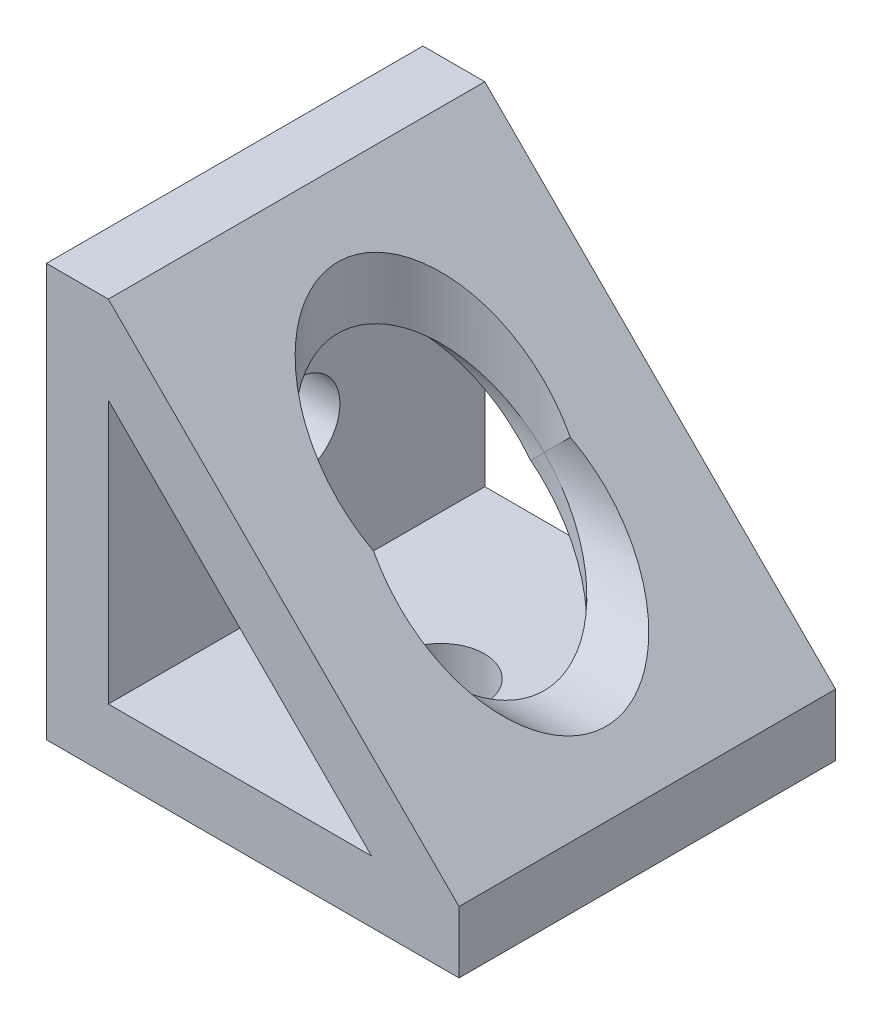
ISO-10303-21;
HEADER;
FILE_DESCRIPTION(('STEP AP214'),'2;1');
FILE_NAME('part.step','',(''),(''),'','','');
FILE_SCHEMA(('AUTOMOTIVE_DESIGN { 1 0 10303 214 1 1 1 1 }'));
ENDSEC;
DATA;
#1=APPLICATION_CONTEXT('core data for automotive mechanical design processes');
#2=APPLICATION_PROTOCOL_DEFINITION('international standard','automotive_design',2000,#1);
#3=PRODUCT_CONTEXT('',#1,'mechanical');
#4=PRODUCT('Part','Part','',(#3));
#5=PRODUCT_RELATED_PRODUCT_CATEGORY('part','',(#4));
#6=PRODUCT_DEFINITION_FORMATION('','',#4);
#7=PRODUCT_DEFINITION_CONTEXT('part definition',#1,'design');
#8=PRODUCT_DEFINITION('design','',#6,#7);
#9=PRODUCT_DEFINITION_SHAPE('','',#8);
#10=(LENGTH_UNIT() NAMED_UNIT(*) SI_UNIT(.MILLI.,.METRE.));
#11=(NAMED_UNIT(*) PLANE_ANGLE_UNIT() SI_UNIT($,.RADIAN.));
#12=(NAMED_UNIT(*) SI_UNIT($,.STERADIAN.) SOLID_ANGLE_UNIT());
#13=UNCERTAINTY_MEASURE_WITH_UNIT(LENGTH_MEASURE(1.E-05),#10,'distance_accuracy_value','');
#14=(GEOMETRIC_REPRESENTATION_CONTEXT(3) GLOBAL_UNCERTAINTY_ASSIGNED_CONTEXT((#13)) GLOBAL_UNIT_ASSIGNED_CONTEXT((#10,
#11,#12)) REPRESENTATION_CONTEXT('',''));
#15=CARTESIAN_POINT('',(0.,0.,0.));
#16=DIRECTION('',(0.,0.,1.));
#17=DIRECTION('',(1.,0.,0.));
#18=AXIS2_PLACEMENT_3D('',#15,#16,#17);
#19=CARTESIAN_POINT('',(0.,20.,0.));
#20=DIRECTION('',(0.,-1.,0.));
#21=DIRECTION('',(0.,0.,-1.));
#22=AXIS2_PLACEMENT_3D('',#19,#20,#21);
#23=CYLINDRICAL_SURFACE('',#22,10.);
#24=CARTESIAN_POINT('',(0.,0.,0.));
#25=DIRECTION('',(-0.707106781186548,-0.707106781186547,0.));
#26=DIRECTION('',(0.707106781186547,-0.707106781186548,0.));
#27=AXIS2_PLACEMENT_3D('',#24,#25,#26);
#28=ELLIPSE('',#27,14.1421356237309,10.);
#29=CARTESIAN_POINT('',(0.,0.,-10.));
#30=VERTEX_POINT('',#29);
#31=CARTESIAN_POINT('',(0.,0.,10.));
#32=VERTEX_POINT('',#31);
#33=EDGE_CURVE('E11',#30,#32,#28,.F.);
#34=ORIENTED_EDGE('',*,*,#33,.F.);
#35=CARTESIAN_POINT('',(0.,0.,0.));
#36=DIRECTION('',(0.707106781186547,-0.707106781186548,0.));
#37=DIRECTION('',(-0.707106781186548,-0.707106781186547,0.));
#38=AXIS2_PLACEMENT_3D('',#35,#36,#37);
#39=ELLIPSE('',#38,14.1421356237309,10.);
#40=CARTESIAN_POINT('',(3.,3.,-9.53939201416945));
#41=VERTEX_POINT('',#40);
#42=EDGE_CURVE('E121',#41,#30,#39,.F.);
#43=ORIENTED_EDGE('',*,*,#42,.F.);
#44=CARTESIAN_POINT('',(0.,6.,0.));
#45=DIRECTION('',(0.707106781186548,0.707106781186548,0.));
#46=DIRECTION('',(0.707106781186548,-0.707106781186548,0.));
#47=AXIS2_PLACEMENT_3D('',#44,#45,#46);
#48=ELLIPSE('',#47,14.1421356237309,10.);
#49=CARTESIAN_POINT('',(3.00000000000001,2.99999999999998,9.53939201416945));
#50=VERTEX_POINT('',#49);
#51=EDGE_CURVE('E205',#50,#41,#48,.F.);
#52=ORIENTED_EDGE('',*,*,#51,.F.);
#53=EDGE_CURVE('E120',#32,#50,#39,.F.);
#54=ORIENTED_EDGE('',*,*,#53,.F.);
#55=EDGE_LOOP('',(#34,#43,#52,#54));
#56=FACE_BOUND('',#55,.T.);
#57=ADVANCED_FACE('F34',(#56),#23,.F.);
#58=CARTESIAN_POINT('',(-14.,20.,-18.25));
#59=DIRECTION('',(0.,1.,0.));
#60=DIRECTION('',(0.,0.,1.));
#61=AXIS2_PLACEMENT_3D('',#58,#59,#60);
#62=PLANE('',#61);
#63=DIRECTION('',(0.,0.,1.));
#64=VECTOR('',#63,1.);
#65=CARTESIAN_POINT('',(-20.,20.,-18.25));
#66=LINE('',#65,#64);
#67=CARTESIAN_POINT('',(-20.,20.,-18.25));
#68=VERTEX_POINT('',#67);
#69=CARTESIAN_POINT('',(-20.,20.,18.25));
#70=VERTEX_POINT('',#69);
#71=EDGE_CURVE('E136',#68,#70,#66,.T.);
#72=ORIENTED_EDGE('',*,*,#71,.T.);
#73=DIRECTION('',(-1.,0.,0.));
#74=VECTOR('',#73,1.);
#75=CARTESIAN_POINT('',(-14.,20.,18.25));
#76=LINE('',#75,#74);
#77=CARTESIAN_POINT('',(-14.,20.,18.25));
#78=VERTEX_POINT('',#77);
#79=EDGE_CURVE('E187',#78,#70,#76,.T.);
#80=ORIENTED_EDGE('',*,*,#79,.F.);
#81=DIRECTION('',(0.,0.,1.));
#82=VECTOR('',#81,1.);
#83=CARTESIAN_POINT('',(-14.,20.,-18.25));
#84=LINE('',#83,#82);
#85=CARTESIAN_POINT('',(-14.,20.,-18.25));
#86=VERTEX_POINT('',#85);
#87=EDGE_CURVE('E131',#86,#78,#84,.T.);
#88=ORIENTED_EDGE('',*,*,#87,.F.);
#89=DIRECTION('',(-1.,0.,0.));
#90=VECTOR('',#89,1.);
#91=CARTESIAN_POINT('',(-14.,20.,-18.25));
#92=LINE('',#91,#90);
#93=EDGE_CURVE('E157',#86,#68,#92,.T.);
#94=ORIENTED_EDGE('',*,*,#93,.T.);
#95=EDGE_LOOP('',(#72,#80,#88,#94));
#96=FACE_BOUND('',#95,.T.);
#97=ADVANCED_FACE('F36',(#96),#62,.T.);
#98=CARTESIAN_POINT('',(20.,-14.,-18.25));
#99=DIRECTION('',(0.707106781186548,0.707106781186548,0.));
#100=DIRECTION('',(-0.707106781186548,0.707106781186548,0.));
#101=AXIS2_PLACEMENT_3D('',#98,#99,#100);
#102=PLANE('',#101);
#103=CARTESIAN_POINT('',(6.,0.,0.));
#104=DIRECTION('',(0.707106781186548,0.707106781186548,0.));
#105=DIRECTION('',(-0.707106781186548,0.707106781186548,0.));
#106=AXIS2_PLACEMENT_3D('',#103,#104,#105);
#107=ELLIPSE('',#106,14.1421356237309,10.);
#108=EDGE_CURVE('E127',#50,#41,#107,.T.);
#109=ORIENTED_EDGE('',*,*,#108,.F.);
#110=ORIENTED_EDGE('',*,*,#51,.T.);
#111=EDGE_LOOP('',(#109,#110));
#112=FACE_BOUND('',#111,.T.);
#113=ORIENTED_EDGE('',*,*,#87,.T.);
#114=DIRECTION('',(-0.707106781186547,0.707106781186547,0.));
#115=VECTOR('',#114,1.);
#116=CARTESIAN_POINT('',(20.,-14.,18.25));
#117=LINE('',#116,#115);
#118=CARTESIAN_POINT('',(20.,-14.,18.25));
#119=VERTEX_POINT('',#118);
#120=EDGE_CURVE('E175',#119,#78,#117,.T.);
#121=ORIENTED_EDGE('',*,*,#120,.F.);
#122=DIRECTION('',(0.,0.,1.));
#123=VECTOR('',#122,1.);
#124=CARTESIAN_POINT('',(20.,-14.,-18.25));
#125=LINE('',#124,#123);
#126=CARTESIAN_POINT('',(20.,-14.,-18.25));
#127=VERTEX_POINT('',#126);
#128=EDGE_CURVE('E143',#127,#119,#125,.T.);
#129=ORIENTED_EDGE('',*,*,#128,.F.);
#130=DIRECTION('',(-0.707106781186547,0.707106781186547,0.));
#131=VECTOR('',#130,1.);
#132=CARTESIAN_POINT('',(20.,-14.,-18.25));
#133=LINE('',#132,#131);
#134=EDGE_CURVE('E139',#127,#86,#133,.T.);
#135=ORIENTED_EDGE('',*,*,#134,.T.);
#136=EDGE_LOOP('',(#113,#121,#129,#135));
#137=FACE_BOUND('',#136,.T.);
#138=ADVANCED_FACE('F248',(#112,#137),#102,.T.);
#139=CARTESIAN_POINT('',(20.,-20.,-18.25));
#140=DIRECTION('',(1.,0.,0.));
#141=DIRECTION('',(0.,0.,-1.));
#142=AXIS2_PLACEMENT_3D('',#139,#140,#141);
#143=PLANE('',#142);
#144=ORIENTED_EDGE('',*,*,#128,.T.);
#145=DIRECTION('',(0.,1.,0.));
#146=VECTOR('',#145,1.);
#147=CARTESIAN_POINT('',(20.,-20.,18.25));
#148=LINE('',#147,#146);
#149=CARTESIAN_POINT('',(20.,-20.,18.25));
#150=VERTEX_POINT('',#149);
#151=EDGE_CURVE('E178',#150,#119,#148,.T.);
#152=ORIENTED_EDGE('',*,*,#151,.F.);
#153=DIRECTION('',(0.,0.,1.));
#154=VECTOR('',#153,1.);
#155=CARTESIAN_POINT('',(20.,-20.,-18.25));
#156=LINE('',#155,#154);
#157=CARTESIAN_POINT('',(20.,-20.,-18.25));
#158=VERTEX_POINT('',#157);
#159=EDGE_CURVE('E141',#158,#150,#156,.T.);
#160=ORIENTED_EDGE('',*,*,#159,.F.);
#161=DIRECTION('',(0.,1.,0.));
#162=VECTOR('',#161,1.);
#163=CARTESIAN_POINT('',(20.,-20.,-18.25));
#164=LINE('',#163,#162);
#165=EDGE_CURVE('E148',#158,#127,#164,.T.);
#166=ORIENTED_EDGE('',*,*,#165,.T.);
#167=EDGE_LOOP('',(#144,#152,#160,#166));
#168=FACE_BOUND('',#167,.T.);
#169=ADVANCED_FACE('F252',(#168),#143,.T.);
#170=CARTESIAN_POINT('',(-20.,-20.,-18.25));
#171=DIRECTION('',(0.,-1.,0.));
#172=DIRECTION('',(0.,0.,-1.));
#173=AXIS2_PLACEMENT_3D('',#170,#171,#172);
#174=PLANE('',#173);
#175=CARTESIAN_POINT('',(0.,-20.,0.));
#176=DIRECTION('',(0.,-1.,0.));
#177=DIRECTION('',(0.,0.,-1.));
#178=AXIS2_PLACEMENT_3D('',#175,#176,#177);
#179=CIRCLE('',#178,4.2);
#180=CARTESIAN_POINT('',(0.,-20.,-4.2));
#181=VERTEX_POINT('',#180);
#182=EDGE_CURVE('E199',#181,#181,#179,.T.);
#183=ORIENTED_EDGE('',*,*,#182,.F.);
#184=EDGE_LOOP('',(#183));
#185=FACE_BOUND('',#184,.T.);
#186=ORIENTED_EDGE('',*,*,#159,.T.);
#187=DIRECTION('',(1.,0.,0.));
#188=VECTOR('',#187,1.);
#189=CARTESIAN_POINT('',(-20.,-20.,18.25));
#190=LINE('',#189,#188);
#191=CARTESIAN_POINT('',(-20.,-20.,18.25));
#192=VERTEX_POINT('',#191);
#193=EDGE_CURVE('E181',#192,#150,#190,.T.);
#194=ORIENTED_EDGE('',*,*,#193,.F.);
#195=DIRECTION('',(0.,0.,1.));
#196=VECTOR('',#195,1.);
#197=CARTESIAN_POINT('',(-20.,-20.,-18.25));
#198=LINE('',#197,#196);
#199=CARTESIAN_POINT('',(-20.,-20.,-18.25));
#200=VERTEX_POINT('',#199);
#201=EDGE_CURVE('E138',#200,#192,#198,.T.);
#202=ORIENTED_EDGE('',*,*,#201,.F.);
#203=DIRECTION('',(1.,0.,0.));
#204=VECTOR('',#203,1.);
#205=CARTESIAN_POINT('',(-20.,-20.,-18.25));
#206=LINE('',#205,#204);
#207=EDGE_CURVE('E151',#200,#158,#206,.T.);
#208=ORIENTED_EDGE('',*,*,#207,.T.);
#209=EDGE_LOOP('',(#186,#194,#202,#208));
#210=FACE_BOUND('',#209,.T.);
#211=ADVANCED_FACE('F254',(#185,#210),#174,.T.);
#212=CARTESIAN_POINT('',(-20.,20.,-18.25));
#213=DIRECTION('',(-1.,0.,0.));
#214=DIRECTION('',(0.,-1.,0.));
#215=AXIS2_PLACEMENT_3D('',#212,#213,#214);
#216=PLANE('',#215);
#217=CARTESIAN_POINT('',(-20.,0.,0.));
#218=DIRECTION('',(1.,0.,0.));
#219=DIRECTION('',(0.,0.,-1.));
#220=AXIS2_PLACEMENT_3D('',#217,#218,#219);
#221=CIRCLE('',#220,4.2);
#222=CARTESIAN_POINT('',(-20.,0.,-4.2));
#223=VERTEX_POINT('',#222);
#224=EDGE_CURVE('E210',#223,#223,#221,.T.);
#225=ORIENTED_EDGE('',*,*,#224,.T.);
#226=EDGE_LOOP('',(#225));
#227=FACE_BOUND('',#226,.T.);
#228=ORIENTED_EDGE('',*,*,#201,.T.);
#229=DIRECTION('',(0.,-1.,0.));
#230=VECTOR('',#229,1.);
#231=CARTESIAN_POINT('',(-20.,20.,18.25));
#232=LINE('',#231,#230);
#233=EDGE_CURVE('E184',#70,#192,#232,.T.);
#234=ORIENTED_EDGE('',*,*,#233,.F.);
#235=ORIENTED_EDGE('',*,*,#71,.F.);
#236=DIRECTION('',(0.,-1.,0.));
#237=VECTOR('',#236,1.);
#238=CARTESIAN_POINT('',(-20.,20.,-18.25));
#239=LINE('',#238,#237);
#240=EDGE_CURVE('E154',#68,#200,#239,.T.);
#241=ORIENTED_EDGE('',*,*,#240,.T.);
#242=EDGE_LOOP('',(#228,#234,#235,#241));
#243=FACE_BOUND('',#242,.T.);
#244=ADVANCED_FACE('F239',(#227,#243),#216,.T.);
#245=CARTESIAN_POINT('',(0.,0.,-18.25));
#246=DIRECTION('',(0.,0.,1.));
#247=DIRECTION('',(1.,0.,0.));
#248=AXIS2_PLACEMENT_3D('',#245,#246,#247);
#249=PLANE('',#248);
#250=DIRECTION('',(1.,0.,0.));
#251=VECTOR('',#250,1.);
#252=CARTESIAN_POINT('',(-14.,-14.,-18.25));
#253=LINE('',#252,#251);
#254=CARTESIAN_POINT('',(-14.,-14.,-18.25));
#255=VERTEX_POINT('',#254);
#256=CARTESIAN_POINT('',(11.5147186257614,-14.,-18.25));
#257=VERTEX_POINT('',#256);
#258=EDGE_CURVE('E164',#255,#257,#253,.T.);
#259=ORIENTED_EDGE('',*,*,#258,.T.);
#260=DIRECTION('',(-0.707106781186547,0.707106781186548,0.));
#261=VECTOR('',#260,1.);
#262=CARTESIAN_POINT('',(11.5147186257614,-14.,-18.25));
#263=LINE('',#262,#261);
#264=CARTESIAN_POINT('',(-14.,11.5147186257614,-18.25));
#265=VERTEX_POINT('',#264);
#266=EDGE_CURVE('E172',#257,#265,#263,.T.);
#267=ORIENTED_EDGE('',*,*,#266,.T.);
#268=DIRECTION('',(0.,-1.,0.));
#269=VECTOR('',#268,1.);
#270=CARTESIAN_POINT('',(-14.,11.5147186257614,-18.25));
#271=LINE('',#270,#269);
#272=EDGE_CURVE('E169',#265,#255,#271,.T.);
#273=ORIENTED_EDGE('',*,*,#272,.T.);
#274=EDGE_LOOP('',(#259,#267,#273));
#275=FACE_BOUND('',#274,.T.);
#276=ORIENTED_EDGE('',*,*,#93,.F.);
#277=ORIENTED_EDGE('',*,*,#134,.F.);
#278=ORIENTED_EDGE('',*,*,#165,.F.);
#279=ORIENTED_EDGE('',*,*,#207,.F.);
#280=ORIENTED_EDGE('',*,*,#240,.F.);
#281=EDGE_LOOP('',(#276,#277,#278,#279,#280));
#282=FACE_BOUND('',#281,.T.);
#283=ADVANCED_FACE('F221',(#275,#282),#249,.F.);
#284=CARTESIAN_POINT('',(11.5147186257614,-14.,-18.25));
#285=DIRECTION('',(0.707106781186548,0.707106781186547,0.));
#286=DIRECTION('',(-0.707106781186547,0.707106781186548,0.));
#287=AXIS2_PLACEMENT_3D('',#284,#285,#286);
#288=PLANE('',#287);
#289=CARTESIAN_POINT('',(0.,-2.48528137423857,0.));
#290=DIRECTION('',(0.707106781186548,0.707106781186547,0.));
#291=DIRECTION('',(0.707106781186547,-0.707106781186548,0.));
#292=AXIS2_PLACEMENT_3D('',#289,#290,#291);
#293=ELLIPSE('',#292,14.1421356237309,10.);
#294=CARTESIAN_POINT('',(-1.24264068711928,-1.24264068711928,-9.92249183031741));
#295=VERTEX_POINT('',#294);
#296=CARTESIAN_POINT('',(-1.24264068711911,-1.24264068711945,9.92249183031741));
#297=VERTEX_POINT('',#296);
#298=EDGE_CURVE('E207',#295,#297,#293,.F.);
#299=ORIENTED_EDGE('',*,*,#298,.F.);
#300=CARTESIAN_POINT('',(-2.48528137423857,0.,0.));
#301=DIRECTION('',(0.707106781186548,0.707106781186547,0.));
#302=DIRECTION('',(-0.707106781186547,0.707106781186548,0.));
#303=AXIS2_PLACEMENT_3D('',#300,#301,#302);
#304=ELLIPSE('',#303,14.1421356237309,10.);
#305=EDGE_CURVE('E55',#295,#297,#304,.T.);
#306=ORIENTED_EDGE('',*,*,#305,.T.);
#307=EDGE_LOOP('',(#299,#306));
#308=FACE_BOUND('',#307,.T.);
#309=DIRECTION('',(0.,0.,1.));
#310=VECTOR('',#309,1.);
#311=CARTESIAN_POINT('',(11.5147186257614,-14.,-18.25));
#312=LINE('',#311,#310);
#313=CARTESIAN_POINT('',(11.5147186257614,-14.,18.25));
#314=VERTEX_POINT('',#313);
#315=EDGE_CURVE('E160',#257,#314,#312,.T.);
#316=ORIENTED_EDGE('',*,*,#315,.T.);
#317=DIRECTION('',(-0.707106781186547,0.707106781186548,0.));
#318=VECTOR('',#317,1.);
#319=CARTESIAN_POINT('',(11.5147186257614,-14.,18.25));
#320=LINE('',#319,#318);
#321=CARTESIAN_POINT('',(-14.,11.5147186257614,18.25));
#322=VERTEX_POINT('',#321);
#323=EDGE_CURVE('E196',#314,#322,#320,.T.);
#324=ORIENTED_EDGE('',*,*,#323,.T.);
#325=DIRECTION('',(0.,0.,1.));
#326=VECTOR('',#325,1.);
#327=CARTESIAN_POINT('',(-14.,11.5147186257614,-18.25));
#328=LINE('',#327,#326);
#329=EDGE_CURVE('E161',#265,#322,#328,.T.);
#330=ORIENTED_EDGE('',*,*,#329,.F.);
#331=ORIENTED_EDGE('',*,*,#266,.F.);
#332=EDGE_LOOP('',(#316,#324,#330,#331));
#333=FACE_BOUND('',#332,.T.);
#334=ADVANCED_FACE('F217',(#308,#333),#288,.F.);
#335=CARTESIAN_POINT('',(-14.,-14.,-18.25));
#336=DIRECTION('',(0.,-1.,0.));
#337=DIRECTION('',(0.,0.,-1.));
#338=AXIS2_PLACEMENT_3D('',#335,#336,#337);
#339=PLANE('',#338);
#340=DIRECTION('',(0.,0.,1.));
#341=VECTOR('',#340,1.);
#342=CARTESIAN_POINT('',(-14.,-14.,-18.25));
#343=LINE('',#342,#341);
#344=CARTESIAN_POINT('',(-14.,-14.,18.25));
#345=VERTEX_POINT('',#344);
#346=EDGE_CURVE('E163',#255,#345,#343,.T.);
#347=ORIENTED_EDGE('',*,*,#346,.T.);
#348=DIRECTION('',(1.,0.,0.));
#349=VECTOR('',#348,1.);
#350=CARTESIAN_POINT('',(-14.,-14.,18.25));
#351=LINE('',#350,#349);
#352=EDGE_CURVE('E190',#345,#314,#351,.T.);
#353=ORIENTED_EDGE('',*,*,#352,.T.);
#354=ORIENTED_EDGE('',*,*,#315,.F.);
#355=ORIENTED_EDGE('',*,*,#258,.F.);
#356=EDGE_LOOP('',(#347,#353,#354,#355));
#357=FACE_BOUND('',#356,.T.);
#358=CARTESIAN_POINT('',(0.,-14.,0.));
#359=DIRECTION('',(0.,-1.,0.));
#360=DIRECTION('',(0.,0.,-1.));
#361=AXIS2_PLACEMENT_3D('',#358,#359,#360);
#362=CIRCLE('',#361,4.2);
#363=CARTESIAN_POINT('',(0.,-14.,-4.2));
#364=VERTEX_POINT('',#363);
#365=EDGE_CURVE('E202',#364,#364,#362,.F.);
#366=ORIENTED_EDGE('',*,*,#365,.F.);
#367=EDGE_LOOP('',(#366));
#368=FACE_BOUND('',#367,.T.);
#369=ADVANCED_FACE('F220',(#357,#368),#339,.F.);
#370=CARTESIAN_POINT('',(-14.,11.5147186257614,-18.25));
#371=DIRECTION('',(-1.,0.,0.));
#372=DIRECTION('',(0.,-1.,0.));
#373=AXIS2_PLACEMENT_3D('',#370,#371,#372);
#374=PLANE('',#373);
#375=ORIENTED_EDGE('',*,*,#329,.T.);
#376=DIRECTION('',(0.,-1.,0.));
#377=VECTOR('',#376,1.);
#378=CARTESIAN_POINT('',(-14.,11.5147186257614,18.25));
#379=LINE('',#378,#377);
#380=EDGE_CURVE('E193',#322,#345,#379,.T.);
#381=ORIENTED_EDGE('',*,*,#380,.T.);
#382=ORIENTED_EDGE('',*,*,#346,.F.);
#383=ORIENTED_EDGE('',*,*,#272,.F.);
#384=EDGE_LOOP('',(#375,#381,#382,#383));
#385=FACE_BOUND('',#384,.T.);
#386=CARTESIAN_POINT('',(-14.,0.,0.));
#387=DIRECTION('',(-1.,0.,0.));
#388=DIRECTION('',(0.,-1.,0.));
#389=AXIS2_PLACEMENT_3D('',#386,#387,#388);
#390=CIRCLE('',#389,4.2);
#391=CARTESIAN_POINT('',(-14.,-4.2,0.));
#392=VERTEX_POINT('',#391);
#393=EDGE_CURVE('E209',#392,#392,#390,.T.);
#394=ORIENTED_EDGE('',*,*,#393,.T.);
#395=EDGE_LOOP('',(#394));
#396=FACE_BOUND('',#395,.T.);
#397=ADVANCED_FACE('F233',(#385,#396),#374,.F.);
#398=CARTESIAN_POINT('',(0.,0.,18.25));
#399=DIRECTION('',(0.,0.,1.));
#400=DIRECTION('',(1.,0.,0.));
#401=AXIS2_PLACEMENT_3D('',#398,#399,#400);
#402=PLANE('',#401);
#403=ORIENTED_EDGE('',*,*,#79,.T.);
#404=ORIENTED_EDGE('',*,*,#233,.T.);
#405=ORIENTED_EDGE('',*,*,#193,.T.);
#406=ORIENTED_EDGE('',*,*,#151,.T.);
#407=ORIENTED_EDGE('',*,*,#120,.T.);
#408=EDGE_LOOP('',(#403,#404,#405,#406,#407));
#409=FACE_BOUND('',#408,.T.);
#410=ORIENTED_EDGE('',*,*,#380,.F.);
#411=ORIENTED_EDGE('',*,*,#323,.F.);
#412=ORIENTED_EDGE('',*,*,#352,.F.);
#413=EDGE_LOOP('',(#410,#411,#412));
#414=FACE_BOUND('',#413,.T.);
#415=ADVANCED_FACE('F231',(#409,#414),#402,.T.);
#416=CARTESIAN_POINT('',(0.,20.001,0.));
#417=DIRECTION('',(0.,-1.,0.));
#418=DIRECTION('',(0.,0.,-1.));
#419=AXIS2_PLACEMENT_3D('',#416,#417,#418);
#420=CYLINDRICAL_SURFACE('',#419,4.2);
#421=ORIENTED_EDGE('',*,*,#182,.T.);
#422=EDGE_LOOP('',(#421));
#423=FACE_BOUND('',#422,.T.);
#424=ORIENTED_EDGE('',*,*,#365,.T.);
#425=EDGE_LOOP('',(#424));
#426=FACE_BOUND('',#425,.T.);
#427=ADVANCED_FACE('F274',(#423,#426),#420,.F.);
#428=CARTESIAN_POINT('',(0.,0.,0.));
#429=DIRECTION('',(-0.707106781186548,-0.707106781186547,0.));
#430=DIRECTION('',(0.707106781186547,-0.707106781186548,0.));
#431=AXIS2_PLACEMENT_3D('',#428,#429,#430);
#432=ELLIPSE('',#431,14.1421356237309,10.);
#433=EDGE_CURVE('E42',#30,#32,#432,.T.);
#434=ORIENTED_EDGE('',*,*,#433,.F.);
#435=CARTESIAN_POINT('',(0.,0.,0.));
#436=DIRECTION('',(0.707106781186547,-0.707106781186548,0.));
#437=DIRECTION('',(-0.707106781186548,-0.707106781186547,0.));
#438=AXIS2_PLACEMENT_3D('',#435,#436,#437);
#439=ELLIPSE('',#438,14.1421356237309,10.);
#440=EDGE_CURVE('E113',#295,#30,#439,.T.);
#441=ORIENTED_EDGE('',*,*,#440,.F.);
#442=ORIENTED_EDGE('',*,*,#298,.T.);
#443=EDGE_CURVE('E123',#32,#297,#439,.T.);
#444=ORIENTED_EDGE('',*,*,#443,.F.);
#445=EDGE_LOOP('',(#434,#441,#442,#444));
#446=FACE_BOUND('',#445,.T.);
#447=ADVANCED_FACE('F134',(#446),#23,.F.);
#448=CARTESIAN_POINT('',(20.001,0.,0.));
#449=DIRECTION('',(-1.,0.,0.));
#450=DIRECTION('',(0.,-1.,0.));
#451=AXIS2_PLACEMENT_3D('',#448,#449,#450);
#452=CYLINDRICAL_SURFACE('',#451,4.2);
#453=ORIENTED_EDGE('',*,*,#224,.F.);
#454=EDGE_LOOP('',(#453));
#455=FACE_BOUND('',#454,.T.);
#456=ORIENTED_EDGE('',*,*,#393,.F.);
#457=EDGE_LOOP('',(#456));
#458=FACE_BOUND('',#457,.T.);
#459=ADVANCED_FACE('F273',(#455,#458),#452,.F.);
#460=CARTESIAN_POINT('',(20.,0.,0.));
#461=DIRECTION('',(-1.,0.,0.));
#462=DIRECTION('',(0.,-1.,0.));
#463=AXIS2_PLACEMENT_3D('',#460,#461,#462);
#464=CYLINDRICAL_SURFACE('',#463,10.);
#465=ORIENTED_EDGE('',*,*,#433,.T.);
#466=ORIENTED_EDGE('',*,*,#53,.T.);
#467=ORIENTED_EDGE('',*,*,#108,.T.);
#468=ORIENTED_EDGE('',*,*,#42,.T.);
#469=EDGE_LOOP('',(#465,#466,#467,#468));
#470=FACE_BOUND('',#469,.T.);
#471=ADVANCED_FACE('F125',(#470),#464,.F.);
#472=ORIENTED_EDGE('',*,*,#33,.T.);
#473=ORIENTED_EDGE('',*,*,#443,.T.);
#474=ORIENTED_EDGE('',*,*,#305,.F.);
#475=ORIENTED_EDGE('',*,*,#440,.T.);
#476=EDGE_LOOP('',(#472,#473,#474,#475));
#477=FACE_BOUND('',#476,.T.);
#478=ADVANCED_FACE('F114',(#477),#464,.F.);
#479=CLOSED_SHELL('',(#57,#97,#138,#169,#211,#244,#283,#334,#369,#397,#415,#427,#447,#459,#471,#478));
#480=MANIFOLD_SOLID_BREP('B2',#479);
#481=ADVANCED_BREP_SHAPE_REPRESENTATION('',(#18,#480),#14);
#482=SHAPE_DEFINITION_REPRESENTATION(#9,#481);
ENDSEC;
END-ISO-10303-21;
